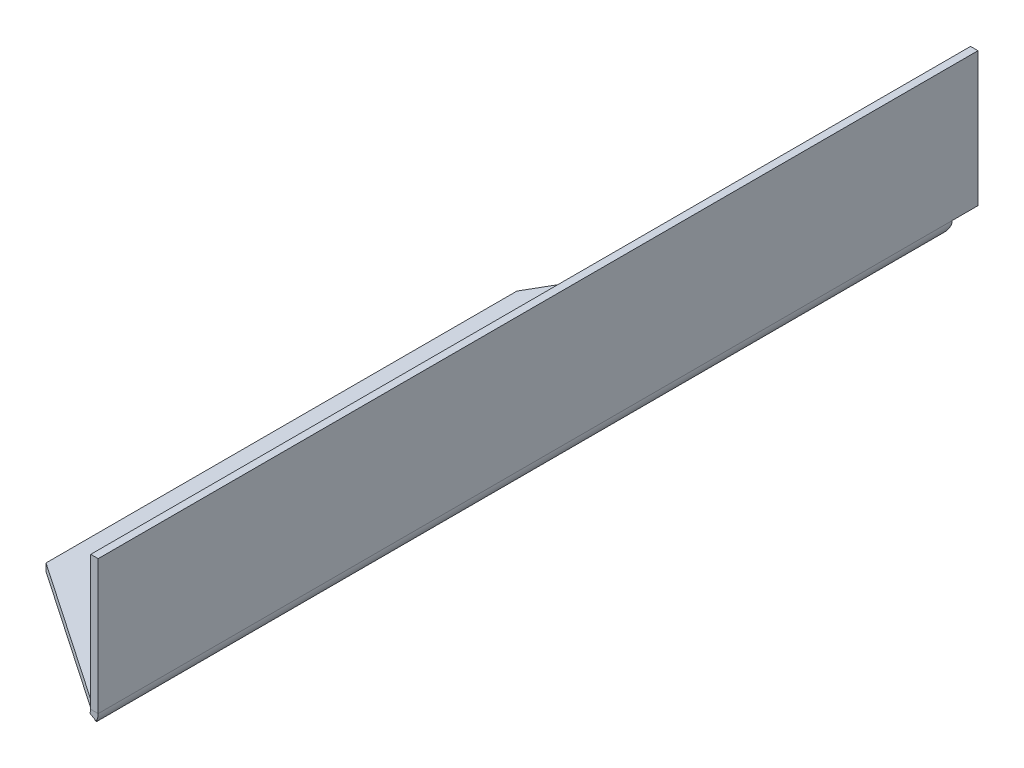
ISO-10303-21;
HEADER;
FILE_DESCRIPTION(('STEP AP214'),'2;1');
FILE_NAME('part.step','',(''),(''),'','','');
FILE_SCHEMA(('AUTOMOTIVE_DESIGN { 1 0 10303 214 1 1 1 1 }'));
ENDSEC;
DATA;
#1=APPLICATION_CONTEXT('core data for automotive mechanical design processes');
#2=APPLICATION_PROTOCOL_DEFINITION('international standard','automotive_design',2000,#1);
#3=PRODUCT_CONTEXT('',#1,'mechanical');
#4=PRODUCT('Part','Part','',(#3));
#5=PRODUCT_RELATED_PRODUCT_CATEGORY('part','',(#4));
#6=PRODUCT_DEFINITION_FORMATION('','',#4);
#7=PRODUCT_DEFINITION_CONTEXT('part definition',#1,'design');
#8=PRODUCT_DEFINITION('design','',#6,#7);
#9=PRODUCT_DEFINITION_SHAPE('','',#8);
#10=(LENGTH_UNIT() NAMED_UNIT(*) SI_UNIT(.MILLI.,.METRE.));
#11=(NAMED_UNIT(*) PLANE_ANGLE_UNIT() SI_UNIT($,.RADIAN.));
#12=(NAMED_UNIT(*) SI_UNIT($,.STERADIAN.) SOLID_ANGLE_UNIT());
#13=UNCERTAINTY_MEASURE_WITH_UNIT(LENGTH_MEASURE(1.E-05),#10,'distance_accuracy_value','');
#14=(GEOMETRIC_REPRESENTATION_CONTEXT(3) GLOBAL_UNCERTAINTY_ASSIGNED_CONTEXT((#13)) GLOBAL_UNIT_ASSIGNED_CONTEXT((#10,
#11,#12)) REPRESENTATION_CONTEXT('',''));
#15=CARTESIAN_POINT('',(0.,0.,0.));
#16=DIRECTION('',(0.,0.,1.));
#17=DIRECTION('',(1.,0.,0.));
#18=AXIS2_PLACEMENT_3D('',#15,#16,#17);
#19=CARTESIAN_POINT('',(20.,-1.,0.));
#20=DIRECTION('',(0.,1.,0.));
#21=DIRECTION('',(0.,0.,1.));
#22=AXIS2_PLACEMENT_3D('',#19,#20,#21);
#23=PLANE('',#22);
#24=DIRECTION('',(-0.826227342807549,0.,-0.563336824641509));
#25=VECTOR('',#24,1.);
#26=CARTESIAN_POINT('',(0.,-1.,-15.));
#27=LINE('',#26,#25);
#28=CARTESIAN_POINT('',(20.,-1.,-1.3636363636364));
#29=VERTEX_POINT('',#28);
#30=CARTESIAN_POINT('',(0.,-1.,-15.));
#31=VERTEX_POINT('',#30);
#32=EDGE_CURVE('E266',#29,#31,#27,.T.);
#33=ORIENTED_EDGE('',*,*,#32,.T.);
#34=DIRECTION('',(0.,0.,-1.));
#35=VECTOR('',#34,1.);
#36=CARTESIAN_POINT('',(0.,-1.,0.));
#37=LINE('',#36,#35);
#38=CARTESIAN_POINT('',(0.,-1.,-78.1628314259153));
#39=VERTEX_POINT('',#38);
#40=EDGE_CURVE('E166',#31,#39,#37,.T.);
#41=ORIENTED_EDGE('',*,*,#40,.T.);
#42=DIRECTION('',(0.499999999999995,0.,-0.866025403784442));
#43=VECTOR('',#42,1.);
#44=CARTESIAN_POINT('',(-28.8454988232815,-1.,-28.2009618943227));
#45=LINE('',#44,#43);
#46=CARTESIAN_POINT('',(20.,-1.,-112.803847577293));
#47=VERTEX_POINT('',#46);
#48=EDGE_CURVE('E195',#39,#47,#45,.T.);
#49=ORIENTED_EDGE('',*,*,#48,.T.);
#50=DIRECTION('',(0.,0.,-1.));
#51=VECTOR('',#50,1.);
#52=CARTESIAN_POINT('',(20.,-1.,0.));
#53=LINE('',#52,#51);
#54=EDGE_CURVE('E67',#29,#47,#53,.T.);
#55=ORIENTED_EDGE('',*,*,#54,.F.);
#56=EDGE_LOOP('',(#33,#41,#49,#55));
#57=FACE_BOUND('',#56,.T.);
#58=ADVANCED_FACE('F59',(#57),#23,.F.);
#59=CARTESIAN_POINT('',(20.,0.,0.));
#60=DIRECTION('',(0.,1.,0.));
#61=DIRECTION('',(0.,0.,1.));
#62=AXIS2_PLACEMENT_3D('',#59,#60,#61);
#63=PLANE('',#62);
#64=DIRECTION('',(0.,0.,-1.));
#65=VECTOR('',#64,1.);
#66=CARTESIAN_POINT('',(0.,0.,0.));
#67=LINE('',#66,#65);
#68=CARTESIAN_POINT('',(0.,0.,-15.));
#69=VERTEX_POINT('',#68);
#70=CARTESIAN_POINT('',(0.,0.,-78.1628314259153));
#71=VERTEX_POINT('',#70);
#72=EDGE_CURVE('E62',#69,#71,#67,.T.);
#73=ORIENTED_EDGE('',*,*,#72,.F.);
#74=DIRECTION('',(-0.826227342807549,0.,-0.563336824641509));
#75=VECTOR('',#74,1.);
#76=CARTESIAN_POINT('',(0.,0.,-15.));
#77=LINE('',#76,#75);
#78=CARTESIAN_POINT('',(20.,0.,-1.3636363636364));
#79=VERTEX_POINT('',#78);
#80=EDGE_CURVE('E269',#79,#69,#77,.T.);
#81=ORIENTED_EDGE('',*,*,#80,.F.);
#82=DIRECTION('',(0.,0.,-1.));
#83=VECTOR('',#82,1.);
#84=CARTESIAN_POINT('',(20.,0.,0.));
#85=LINE('',#84,#83);
#86=CARTESIAN_POINT('',(20.,0.,-112.803847577293));
#87=VERTEX_POINT('',#86);
#88=EDGE_CURVE('E13',#79,#87,#85,.T.);
#89=ORIENTED_EDGE('',*,*,#88,.T.);
#90=DIRECTION('',(0.499999999999995,0.,-0.866025403784442));
#91=VECTOR('',#90,1.);
#92=CARTESIAN_POINT('',(-28.8454988232815,0.,-28.2009618943227));
#93=LINE('',#92,#91);
#94=EDGE_CURVE('E193',#71,#87,#93,.T.);
#95=ORIENTED_EDGE('',*,*,#94,.F.);
#96=EDGE_LOOP('',(#73,#81,#89,#95));
#97=FACE_BOUND('',#96,.T.);
#98=ADVANCED_FACE('F198',(#97),#63,.T.);
#99=CARTESIAN_POINT('',(0.,0.,0.));
#100=DIRECTION('',(-1.,0.,0.));
#101=DIRECTION('',(0.,0.,1.));
#102=AXIS2_PLACEMENT_3D('',#99,#100,#101);
#103=PLANE('',#102);
#104=ORIENTED_EDGE('',*,*,#40,.F.);
#105=DIRECTION('',(0.,-1.,0.));
#106=VECTOR('',#105,1.);
#107=CARTESIAN_POINT('',(0.,-1.,-15.));
#108=LINE('',#107,#106);
#109=EDGE_CURVE('E185',#31,#69,#108,.F.);
#110=ORIENTED_EDGE('',*,*,#109,.T.);
#111=ORIENTED_EDGE('',*,*,#72,.T.);
#112=DIRECTION('',(0.,1.,0.));
#113=VECTOR('',#112,1.);
#114=CARTESIAN_POINT('',(0.,0.,-78.1628314259153));
#115=LINE('',#114,#113);
#116=EDGE_CURVE('E184',#71,#39,#115,.F.);
#117=ORIENTED_EDGE('',*,*,#116,.T.);
#118=EDGE_LOOP('',(#104,#110,#111,#117));
#119=FACE_BOUND('',#118,.T.);
#120=ADVANCED_FACE('F183',(#119),#103,.T.);
#121=CARTESIAN_POINT('',(20.,0.999999999999997,-118.));
#122=DIRECTION('',(0.,0.,-1.));
#123=DIRECTION('',(1.,0.,0.));
#124=AXIS2_PLACEMENT_3D('',#121,#122,#123);
#125=CYLINDRICAL_SURFACE('',#124,2.);
#126=CARTESIAN_POINT('',(20.,0.999999999999997,0.));
#127=DIRECTION('',(0.,0.,-1.));
#128=DIRECTION('',(-1.,0.,0.));
#129=AXIS2_PLACEMENT_3D('',#126,#127,#128);
#130=CIRCLE('',#129,2.);
#131=CARTESIAN_POINT('',(21.7320508075689,0.,0.));
#132=VERTEX_POINT('',#131);
#133=CARTESIAN_POINT('',(22.,0.99999999999999,0.));
#134=VERTEX_POINT('',#133);
#135=EDGE_CURVE('E163',#132,#134,#130,.F.);
#136=ORIENTED_EDGE('',*,*,#135,.F.);
#137=DIRECTION('',(0.,0.,-1.));
#138=VECTOR('',#137,1.);
#139=CARTESIAN_POINT('',(21.7320508075689,0.,-118.));
#140=LINE('',#139,#138);
#141=CARTESIAN_POINT('',(21.7320508075689,0.,-0.182692631203076));
#142=VERTEX_POINT('',#141);
#143=EDGE_CURVE('E75',#132,#142,#140,.T.);
#144=ORIENTED_EDGE('',*,*,#143,.T.);
#145=CARTESIAN_POINT('',(20.,0.999999999999997,-1.3636363636364));
#146=DIRECTION('',(0.563336824641509,0.,-0.826227342807549));
#147=DIRECTION('',(-0.826227342807549,0.,-0.563336824641509));
#148=AXIS2_PLACEMENT_3D('',#145,#146,#147);
#149=ELLIPSE('',#148,2.4206412646717,2.);
#150=EDGE_CURVE('E264',#29,#142,#149,.F.);
#151=ORIENTED_EDGE('',*,*,#150,.F.);
#152=ORIENTED_EDGE('',*,*,#54,.T.);
#153=CARTESIAN_POINT('',(20.,0.999999999999997,-112.803847577293));
#154=DIRECTION('',(0.654653670707982,0.,0.755928946018451));
#155=DIRECTION('',(0.755928946018451,0.,-0.654653670707982));
#156=AXIS2_PLACEMENT_3D('',#153,#154,#155);
#157=ELLIPSE('',#156,2.64575131106461,2.);
#158=CARTESIAN_POINT('',(22.,0.999999999999984,-114.535898384862));
#159=VERTEX_POINT('',#158);
#160=EDGE_CURVE('E250',#159,#47,#157,.F.);
#161=ORIENTED_EDGE('',*,*,#160,.F.);
#162=DIRECTION('',(0.,0.,-1.));
#163=VECTOR('',#162,1.);
#164=CARTESIAN_POINT('',(22.,0.999999999999994,0.));
#165=LINE('',#164,#163);
#166=EDGE_CURVE('E224',#159,#134,#165,.F.);
#167=ORIENTED_EDGE('',*,*,#166,.T.);
#168=EDGE_LOOP('',(#136,#144,#151,#152,#161,#167));
#169=FACE_BOUND('',#168,.T.);
#170=ADVANCED_FACE('F261',(#169),#125,.T.);
#171=CARTESIAN_POINT('',(20.,0.999999999999997,-118.));
#172=DIRECTION('',(0.,0.,-1.));
#173=DIRECTION('',(1.,0.,0.));
#174=AXIS2_PLACEMENT_3D('',#171,#172,#173);
#175=CYLINDRICAL_SURFACE('',#174,1.);
#176=DIRECTION('',(0.,0.,-1.));
#177=VECTOR('',#176,1.);
#178=CARTESIAN_POINT('',(20.8660254037844,0.499999999999998,-118.));
#179=LINE('',#178,#177);
#180=CARTESIAN_POINT('',(20.8660254037844,0.499999999999998,0.));
#181=VERTEX_POINT('',#180);
#182=CARTESIAN_POINT('',(20.8660254037844,0.499999999999999,-0.182692631203074));
#183=VERTEX_POINT('',#182);
#184=EDGE_CURVE('E143',#181,#183,#179,.T.);
#185=ORIENTED_EDGE('',*,*,#184,.F.);
#186=CARTESIAN_POINT('',(20.,0.999999999999997,0.));
#187=DIRECTION('',(0.,0.,-1.));
#188=DIRECTION('',(-1.,0.,0.));
#189=AXIS2_PLACEMENT_3D('',#186,#187,#188);
#190=CIRCLE('',#189,1.);
#191=CARTESIAN_POINT('',(21.,0.999999999999994,0.));
#192=VERTEX_POINT('',#191);
#193=EDGE_CURVE('E154',#181,#192,#190,.F.);
#194=ORIENTED_EDGE('',*,*,#193,.T.);
#195=DIRECTION('',(0.,0.,-1.));
#196=VECTOR('',#195,1.);
#197=CARTESIAN_POINT('',(21.,0.999999999999997,0.));
#198=LINE('',#197,#196);
#199=CARTESIAN_POINT('',(21.,0.999999999999991,-114.535898384862));
#200=VERTEX_POINT('',#199);
#201=EDGE_CURVE('E227',#192,#200,#198,.T.);
#202=ORIENTED_EDGE('',*,*,#201,.T.);
#203=CARTESIAN_POINT('',(20.,0.999999999999997,-112.803847577293));
#204=DIRECTION('',(0.866025403784442,0.,0.499999999999995));
#205=DIRECTION('',(0.499999999999995,0.,-0.866025403784442));
#206=AXIS2_PLACEMENT_3D('',#203,#204,#205);
#207=ELLIPSE('',#206,2.00000000000002,1.);
#208=EDGE_CURVE('E248',#200,#87,#207,.F.);
#209=ORIENTED_EDGE('',*,*,#208,.T.);
#210=ORIENTED_EDGE('',*,*,#88,.F.);
#211=CARTESIAN_POINT('',(20.,0.999999999999997,-1.3636363636364));
#212=DIRECTION('',(0.806404995855705,0.,-0.591363663627519));
#213=DIRECTION('',(-0.591363663627519,0.,-0.806404995855704));
#214=AXIS2_PLACEMENT_3D('',#211,#212,#213);
#215=ELLIPSE('',#214,1.69100683979439,1.);
#216=EDGE_CURVE('E157',#79,#183,#215,.F.);
#217=ORIENTED_EDGE('',*,*,#216,.T.);
#218=EDGE_LOOP('',(#185,#194,#202,#209,#210,#217));
#219=FACE_BOUND('',#218,.T.);
#220=ADVANCED_FACE('F152',(#219),#175,.F.);
#221=CARTESIAN_POINT('',(20.,0.999999999999997,0.));
#222=DIRECTION('',(0.,0.,1.));
#223=DIRECTION('',(1.,0.,0.));
#224=AXIS2_PLACEMENT_3D('',#221,#222,#223);
#225=PLANE('',#224);
#226=ORIENTED_EDGE('',*,*,#193,.F.);
#227=DIRECTION('',(0.866025403784439,-0.499999999999999,0.));
#228=VECTOR('',#227,1.);
#229=CARTESIAN_POINT('',(21.7320508075689,0.,0.));
#230=LINE('',#229,#228);
#231=EDGE_CURVE('E140',#132,#181,#230,.F.);
#232=ORIENTED_EDGE('',*,*,#231,.F.);
#233=ORIENTED_EDGE('',*,*,#135,.T.);
#234=DIRECTION('',(-1.,0.,0.));
#235=VECTOR('',#234,1.);
#236=CARTESIAN_POINT('',(22.,0.999999999999994,0.));
#237=LINE('',#236,#235);
#238=EDGE_CURVE('E161',#192,#134,#237,.F.);
#239=ORIENTED_EDGE('',*,*,#238,.F.);
#240=EDGE_LOOP('',(#226,#232,#233,#239));
#241=FACE_BOUND('',#240,.T.);
#242=ADVANCED_FACE('F159',(#241),#225,.T.);
#243=CARTESIAN_POINT('',(22.,0.,0.));
#244=DIRECTION('',(0.,0.,-1.));
#245=DIRECTION('',(-1.,0.,0.));
#246=AXIS2_PLACEMENT_3D('',#243,#244,#245);
#247=PLANE('',#246);
#248=ORIENTED_EDGE('',*,*,#238,.T.);
#249=DIRECTION('',(0.,-1.,0.));
#250=VECTOR('',#249,1.);
#251=CARTESIAN_POINT('',(22.,0.,0.));
#252=LINE('',#251,#250);
#253=CARTESIAN_POINT('',(22.0000000000001,19.,0.));
#254=VERTEX_POINT('',#253);
#255=EDGE_CURVE('E212',#254,#134,#252,.T.);
#256=ORIENTED_EDGE('',*,*,#255,.F.);
#257=DIRECTION('',(-1.,0.,0.));
#258=VECTOR('',#257,1.);
#259=CARTESIAN_POINT('',(22.0000000000001,19.,0.));
#260=LINE('',#259,#258);
#261=CARTESIAN_POINT('',(21.0000000000001,19.,0.));
#262=VERTEX_POINT('',#261);
#263=EDGE_CURVE('E169',#254,#262,#260,.T.);
#264=ORIENTED_EDGE('',*,*,#263,.T.);
#265=DIRECTION('',(0.,1.,0.));
#266=VECTOR('',#265,1.);
#267=CARTESIAN_POINT('',(21.,0.,0.));
#268=LINE('',#267,#266);
#269=EDGE_CURVE('E219',#262,#192,#268,.F.);
#270=ORIENTED_EDGE('',*,*,#269,.T.);
#271=EDGE_LOOP('',(#248,#256,#264,#270));
#272=FACE_BOUND('',#271,.T.);
#273=ADVANCED_FACE('F230',(#272),#247,.F.);
#274=CARTESIAN_POINT('',(22.0000000000001,19.,-118.));
#275=DIRECTION('',(0.,0.,1.));
#276=DIRECTION('',(1.,0.,0.));
#277=AXIS2_PLACEMENT_3D('',#274,#275,#276);
#278=PLANE('',#277);
#279=DIRECTION('',(-1.,0.,0.));
#280=VECTOR('',#279,1.);
#281=CARTESIAN_POINT('',(21.,0.99999999999999,-118.));
#282=LINE('',#281,#280);
#283=CARTESIAN_POINT('',(21.,0.999999999999992,-118.));
#284=VERTEX_POINT('',#283);
#285=CARTESIAN_POINT('',(22.,1.,-118.));
#286=VERTEX_POINT('',#285);
#287=EDGE_CURVE('E225',#284,#286,#282,.F.);
#288=ORIENTED_EDGE('',*,*,#287,.F.);
#289=DIRECTION('',(0.,-1.,0.));
#290=VECTOR('',#289,1.);
#291=CARTESIAN_POINT('',(21.0000000000001,19.,-118.));
#292=LINE('',#291,#290);
#293=CARTESIAN_POINT('',(21.0000000000001,19.,-118.));
#294=VERTEX_POINT('',#293);
#295=EDGE_CURVE('E217',#284,#294,#292,.F.);
#296=ORIENTED_EDGE('',*,*,#295,.T.);
#297=DIRECTION('',(-1.,0.,0.));
#298=VECTOR('',#297,1.);
#299=CARTESIAN_POINT('',(22.0000000000001,19.,-118.));
#300=LINE('',#299,#298);
#301=CARTESIAN_POINT('',(22.0000000000001,19.,-118.));
#302=VERTEX_POINT('',#301);
#303=EDGE_CURVE('E164',#302,#294,#300,.T.);
#304=ORIENTED_EDGE('',*,*,#303,.F.);
#305=DIRECTION('',(0.,1.,0.));
#306=VECTOR('',#305,1.);
#307=CARTESIAN_POINT('',(22.,0.,-118.));
#308=LINE('',#307,#306);
#309=EDGE_CURVE('E210',#286,#302,#308,.T.);
#310=ORIENTED_EDGE('',*,*,#309,.F.);
#311=EDGE_LOOP('',(#288,#296,#304,#310));
#312=FACE_BOUND('',#311,.T.);
#313=ADVANCED_FACE('F305',(#312),#278,.F.);
#314=CARTESIAN_POINT('',(22.,0.,0.));
#315=DIRECTION('',(-1.,0.,0.));
#316=DIRECTION('',(0.,-1.,0.));
#317=AXIS2_PLACEMENT_3D('',#314,#315,#316);
#318=PLANE('',#317);
#319=EDGE_CURVE('E222',#286,#159,#165,.F.);
#320=ORIENTED_EDGE('',*,*,#319,.F.);
#321=ORIENTED_EDGE('',*,*,#309,.T.);
#322=DIRECTION('',(0.,0.,1.));
#323=VECTOR('',#322,1.);
#324=CARTESIAN_POINT('',(22.0000000000001,19.,0.));
#325=LINE('',#324,#323);
#326=EDGE_CURVE('E208',#302,#254,#325,.T.);
#327=ORIENTED_EDGE('',*,*,#326,.T.);
#328=ORIENTED_EDGE('',*,*,#255,.T.);
#329=ORIENTED_EDGE('',*,*,#166,.F.);
#330=EDGE_LOOP('',(#320,#321,#327,#328,#329));
#331=FACE_BOUND('',#330,.T.);
#332=ADVANCED_FACE('F235',(#331),#318,.F.);
#333=CARTESIAN_POINT('',(21.,0.,0.));
#334=DIRECTION('',(-1.,0.,0.));
#335=DIRECTION('',(0.,-1.,0.));
#336=AXIS2_PLACEMENT_3D('',#333,#334,#335);
#337=PLANE('',#336);
#338=ORIENTED_EDGE('',*,*,#295,.F.);
#339=DIRECTION('',(0.,0.,-1.));
#340=VECTOR('',#339,1.);
#341=CARTESIAN_POINT('',(21.,0.999999999999992,-118.));
#342=LINE('',#341,#340);
#343=EDGE_CURVE('E199',#284,#200,#342,.F.);
#344=ORIENTED_EDGE('',*,*,#343,.T.);
#345=ORIENTED_EDGE('',*,*,#201,.F.);
#346=ORIENTED_EDGE('',*,*,#269,.F.);
#347=DIRECTION('',(0.,0.,-1.));
#348=VECTOR('',#347,1.);
#349=CARTESIAN_POINT('',(21.0000000000001,19.,0.));
#350=LINE('',#349,#348);
#351=EDGE_CURVE('E215',#294,#262,#350,.F.);
#352=ORIENTED_EDGE('',*,*,#351,.F.);
#353=EDGE_LOOP('',(#338,#344,#345,#346,#352));
#354=FACE_BOUND('',#353,.T.);
#355=ADVANCED_FACE('F246',(#354),#337,.T.);
#356=CARTESIAN_POINT('',(22.0000000000001,19.,0.));
#357=DIRECTION('',(0.,-1.,0.));
#358=DIRECTION('',(1.,0.,0.));
#359=AXIS2_PLACEMENT_3D('',#356,#357,#358);
#360=PLANE('',#359);
#361=ORIENTED_EDGE('',*,*,#351,.T.);
#362=ORIENTED_EDGE('',*,*,#263,.F.);
#363=ORIENTED_EDGE('',*,*,#326,.F.);
#364=ORIENTED_EDGE('',*,*,#303,.T.);
#365=EDGE_LOOP('',(#361,#362,#363,#364));
#366=FACE_BOUND('',#365,.T.);
#367=ADVANCED_FACE('F242',(#366),#360,.F.);
#368=CARTESIAN_POINT('',(-28.8454988232815,0.,-28.2009618943227));
#369=DIRECTION('',(0.866025403784442,0.,0.499999999999995));
#370=DIRECTION('',(0.499999999999995,0.,-0.866025403784442));
#371=AXIS2_PLACEMENT_3D('',#368,#369,#370);
#372=PLANE('',#371);
#373=ORIENTED_EDGE('',*,*,#94,.T.);
#374=DIRECTION('',(0.,1.,0.));
#375=VECTOR('',#374,1.);
#376=CARTESIAN_POINT('',(20.,0.,-112.803847577293));
#377=LINE('',#376,#375);
#378=EDGE_CURVE('E196',#87,#47,#377,.F.);
#379=ORIENTED_EDGE('',*,*,#378,.T.);
#380=ORIENTED_EDGE('',*,*,#48,.F.);
#381=ORIENTED_EDGE('',*,*,#116,.F.);
#382=EDGE_LOOP('',(#373,#379,#380,#381));
#383=FACE_BOUND('',#382,.T.);
#384=ADVANCED_FACE('F191',(#383),#372,.F.);
#385=CARTESIAN_POINT('',(22.,0.999999999999987,-117.133974596216));
#386=DIRECTION('',(0.,-1.,0.));
#387=DIRECTION('',(0.,0.,-1.));
#388=AXIS2_PLACEMENT_3D('',#385,#386,#387);
#389=PLANE('',#388);
#390=ORIENTED_EDGE('',*,*,#287,.T.);
#391=ORIENTED_EDGE('',*,*,#319,.T.);
#392=DIRECTION('',(-1.,0.,0.));
#393=VECTOR('',#392,1.);
#394=CARTESIAN_POINT('',(21.,0.999999999999991,-114.535898384862));
#395=LINE('',#394,#393);
#396=EDGE_CURVE('E83',#200,#159,#395,.F.);
#397=ORIENTED_EDGE('',*,*,#396,.F.);
#398=ORIENTED_EDGE('',*,*,#343,.F.);
#399=EDGE_LOOP('',(#390,#391,#397,#398));
#400=FACE_BOUND('',#399,.T.);
#401=ADVANCED_FACE('F317',(#400),#389,.T.);
#402=CARTESIAN_POINT('',(22.,0.999999999999997,-114.535898384862));
#403=CARTESIAN_POINT('',(21.6666666666667,0.999999999999997,-114.535898384862));
#404=CARTESIAN_POINT('',(21.3333333333333,0.999999999999997,-114.535898384862));
#405=CARTESIAN_POINT('',(21.,0.999999999999997,-114.535898384862));
#406=CARTESIAN_POINT('',(22.,-3.00000000000001,-114.535898384862));
#407=CARTESIAN_POINT('',(21.6666666666667,-2.33333333333334,-114.535898384862));
#408=CARTESIAN_POINT('',(21.3333333333333,-1.66666666666667,-114.535898384862));
#409=CARTESIAN_POINT('',(21.,-1.,-114.535898384862));
#410=CARTESIAN_POINT('',(18.,-3.00000000000001,-111.071796769724));
#411=CARTESIAN_POINT('',(18.3333333333333,-2.33333333333334,-111.071796769724));
#412=CARTESIAN_POINT('',(18.6666666666667,-1.66666666666667,-111.071796769724));
#413=CARTESIAN_POINT('',(19.,-1.,-111.071796769724));
#414=CARTESIAN_POINT('',(18.,0.999999999999998,-111.071796769724));
#415=CARTESIAN_POINT('',(18.3333333333333,0.999999999999998,-111.071796769724));
#416=CARTESIAN_POINT('',(18.6666666666667,0.999999999999998,-111.071796769724));
#417=CARTESIAN_POINT('',(19.,0.999999999999998,-111.071796769724));
#418=CARTESIAN_POINT('',(18.,5.,-111.071796769724));
#419=CARTESIAN_POINT('',(18.3333333333333,4.33333333333333,-111.071796769724));
#420=CARTESIAN_POINT('',(18.6666666666667,3.66666666666667,-111.071796769724));
#421=CARTESIAN_POINT('',(19.,3.,-111.071796769724));
#422=CARTESIAN_POINT('',(22.,5.,-114.535898384862));
#423=CARTESIAN_POINT('',(21.6666666666667,4.33333333333333,-114.535898384862));
#424=CARTESIAN_POINT('',(21.3333333333333,3.66666666666667,-114.535898384862));
#425=CARTESIAN_POINT('',(21.,3.,-114.535898384862));
#426=CARTESIAN_POINT('',(22.,0.999999999999997,-114.535898384862));
#427=CARTESIAN_POINT('',(21.6666666666667,0.999999999999997,-114.535898384862));
#428=CARTESIAN_POINT('',(21.3333333333333,0.999999999999997,-114.535898384862));
#429=CARTESIAN_POINT('',(21.,0.999999999999997,-114.535898384862));
#430=(BOUNDED_SURFACE() B_SPLINE_SURFACE(3,3,((#402,#403,#404,#405),(#406,#407,#408,#409),(#410,
#411,#412,#413),(#414,#415,#416,#417),(#418,#419,#420,#421),(#422,#423,#424,#425),(#426,#427,
#428,#429)),.UNSPECIFIED.,.T.,.F.,.F.) B_SPLINE_SURFACE_WITH_KNOTS((4,3,4),(4,4),(0.,0.5,1.),
(0.,1.),.UNSPECIFIED.) GEOMETRIC_REPRESENTATION_ITEM() RATIONAL_B_SPLINE_SURFACE(((1.,1.,1.,1.),
(0.333333333333333,0.333333333333333,0.333333333333333,0.333333333333333),(0.333333333333333,
0.333333333333333,0.333333333333333,0.333333333333333),(1.,1.,1.,1.),(0.333333333333333,
0.333333333333333,0.333333333333333,0.333333333333333),(0.333333333333333,0.333333333333333,
0.333333333333333,0.333333333333333),(1.,1.,1.,1.))) REPRESENTATION_ITEM('') SURFACE());
#431=ORIENTED_EDGE('',*,*,#378,.F.);
#432=ORIENTED_EDGE('',*,*,#208,.F.);
#433=ORIENTED_EDGE('',*,*,#396,.T.);
#434=ORIENTED_EDGE('',*,*,#160,.T.);
#435=EDGE_LOOP('',(#431,#432,#433,#434));
#436=FACE_BOUND('',#435,.T.);
#437=ADVANCED_FACE('F259',(#436),#430,.T.);
#438=CARTESIAN_POINT('',(0.,-1.,-15.));
#439=DIRECTION('',(0.563336824641509,0.,-0.826227342807549));
#440=DIRECTION('',(-0.826227342807549,0.,-0.563336824641509));
#441=AXIS2_PLACEMENT_3D('',#438,#439,#440);
#442=PLANE('',#441);
#443=ORIENTED_EDGE('',*,*,#109,.F.);
#444=ORIENTED_EDGE('',*,*,#32,.F.);
#445=DIRECTION('',(0.,-1.,0.));
#446=VECTOR('',#445,1.);
#447=CARTESIAN_POINT('',(20.,-1.,-1.3636363636364));
#448=LINE('',#447,#446);
#449=EDGE_CURVE('E254',#29,#79,#448,.F.);
#450=ORIENTED_EDGE('',*,*,#449,.T.);
#451=ORIENTED_EDGE('',*,*,#80,.T.);
#452=EDGE_LOOP('',(#443,#444,#450,#451));
#453=FACE_BOUND('',#452,.T.);
#454=ADVANCED_FACE('F273',(#453),#442,.F.);
#455=CARTESIAN_POINT('',(21.7320508075689,0.,-0.0913463156015371));
#456=DIRECTION('',(-0.499999999999999,-0.866025403784439,0.));
#457=DIRECTION('',(0.,0.,-1.));
#458=AXIS2_PLACEMENT_3D('',#455,#456,#457);
#459=PLANE('',#458);
#460=DIRECTION('',(0.86602540378444,-0.499999999999998,0.));
#461=VECTOR('',#460,1.);
#462=CARTESIAN_POINT('',(21.7320508075689,0.,-0.182692631203076));
#463=LINE('',#462,#461);
#464=EDGE_CURVE('E148',#142,#183,#463,.F.);
#465=ORIENTED_EDGE('',*,*,#464,.F.);
#466=ORIENTED_EDGE('',*,*,#143,.F.);
#467=ORIENTED_EDGE('',*,*,#231,.T.);
#468=ORIENTED_EDGE('',*,*,#184,.T.);
#469=EDGE_LOOP('',(#465,#466,#467,#468));
#470=FACE_BOUND('',#469,.T.);
#471=ADVANCED_FACE('F142',(#470),#459,.T.);
#472=CARTESIAN_POINT('',(18.,0.999999999999997,-2.72727272727276));
#473=CARTESIAN_POINT('',(18.3333333333333,0.999999999999997,-2.72727272727276));
#474=CARTESIAN_POINT('',(18.6666666666667,0.999999999999997,-2.72727272727276));
#475=CARTESIAN_POINT('',(19.,0.999999999999997,-2.72727272727276));
#476=CARTESIAN_POINT('',(18.,-3.,-2.72727272727276));
#477=CARTESIAN_POINT('',(18.3333333333333,-2.33333333333334,-2.72727272727276));
#478=CARTESIAN_POINT('',(18.6666666666667,-1.66666666666667,-2.72727272727276));
#479=CARTESIAN_POINT('',(19.,-1.,-2.72727272727276));
#480=CARTESIAN_POINT('',(22.,-3.,0.));
#481=CARTESIAN_POINT('',(21.6666666666667,-2.33333333333334,0.));
#482=CARTESIAN_POINT('',(21.3333333333333,-1.66666666666667,0.));
#483=CARTESIAN_POINT('',(21.,-1.,0.));
#484=CARTESIAN_POINT('',(22.,0.999999999999998,0.));
#485=CARTESIAN_POINT('',(21.6666666666667,0.999999999999998,0.));
#486=CARTESIAN_POINT('',(21.3333333333333,0.999999999999998,0.));
#487=CARTESIAN_POINT('',(21.,0.999999999999998,0.));
#488=CARTESIAN_POINT('',(22.,5.,0.));
#489=CARTESIAN_POINT('',(21.6666666666667,4.33333333333333,0.));
#490=CARTESIAN_POINT('',(21.3333333333333,3.66666666666667,0.));
#491=CARTESIAN_POINT('',(21.,3.,0.));
#492=CARTESIAN_POINT('',(18.,5.,-2.72727272727276));
#493=CARTESIAN_POINT('',(18.3333333333333,4.33333333333333,-2.72727272727276));
#494=CARTESIAN_POINT('',(18.6666666666667,3.66666666666667,-2.72727272727276));
#495=CARTESIAN_POINT('',(19.,3.,-2.72727272727276));
#496=CARTESIAN_POINT('',(18.,0.999999999999997,-2.72727272727276));
#497=CARTESIAN_POINT('',(18.3333333333333,0.999999999999997,-2.72727272727276));
#498=CARTESIAN_POINT('',(18.6666666666667,0.999999999999997,-2.72727272727276));
#499=CARTESIAN_POINT('',(19.,0.999999999999997,-2.72727272727276));
#500=(BOUNDED_SURFACE() B_SPLINE_SURFACE(3,3,((#472,#473,#474,#475),(#476,#477,#478,#479),(#480,
#481,#482,#483),(#484,#485,#486,#487),(#488,#489,#490,#491),(#492,#493,#494,#495),(#496,#497,
#498,#499)),.UNSPECIFIED.,.T.,.F.,.F.) B_SPLINE_SURFACE_WITH_KNOTS((4,3,4),(4,4),(0.,0.5,1.),
(0.,1.),.UNSPECIFIED.) GEOMETRIC_REPRESENTATION_ITEM() RATIONAL_B_SPLINE_SURFACE(((1.,1.,1.,1.),
(0.333333333333333,0.333333333333333,0.333333333333333,0.333333333333333),(0.333333333333333,
0.333333333333333,0.333333333333333,0.333333333333333),(1.,1.,1.,1.),(0.333333333333333,
0.333333333333333,0.333333333333333,0.333333333333333),(0.333333333333333,0.333333333333333,
0.333333333333333,0.333333333333333),(1.,1.,1.,1.))) REPRESENTATION_ITEM('') SURFACE());
#501=ORIENTED_EDGE('',*,*,#150,.T.);
#502=ORIENTED_EDGE('',*,*,#464,.T.);
#503=ORIENTED_EDGE('',*,*,#216,.F.);
#504=ORIENTED_EDGE('',*,*,#449,.F.);
#505=EDGE_LOOP('',(#501,#502,#503,#504));
#506=FACE_BOUND('',#505,.T.);
#507=ADVANCED_FACE('F275',(#506),#500,.T.);
#508=CLOSED_SHELL('',(#58,#98,#120,#170,#220,#242,#273,#313,#332,#355,#367,#384,#401,#437,#454,
#471,#507));
#509=MANIFOLD_SOLID_BREP('B2',#508);
#510=ADVANCED_BREP_SHAPE_REPRESENTATION('',(#18,#509),#14);
#511=SHAPE_DEFINITION_REPRESENTATION(#9,#510);
ENDSEC;
END-ISO-10303-21;
